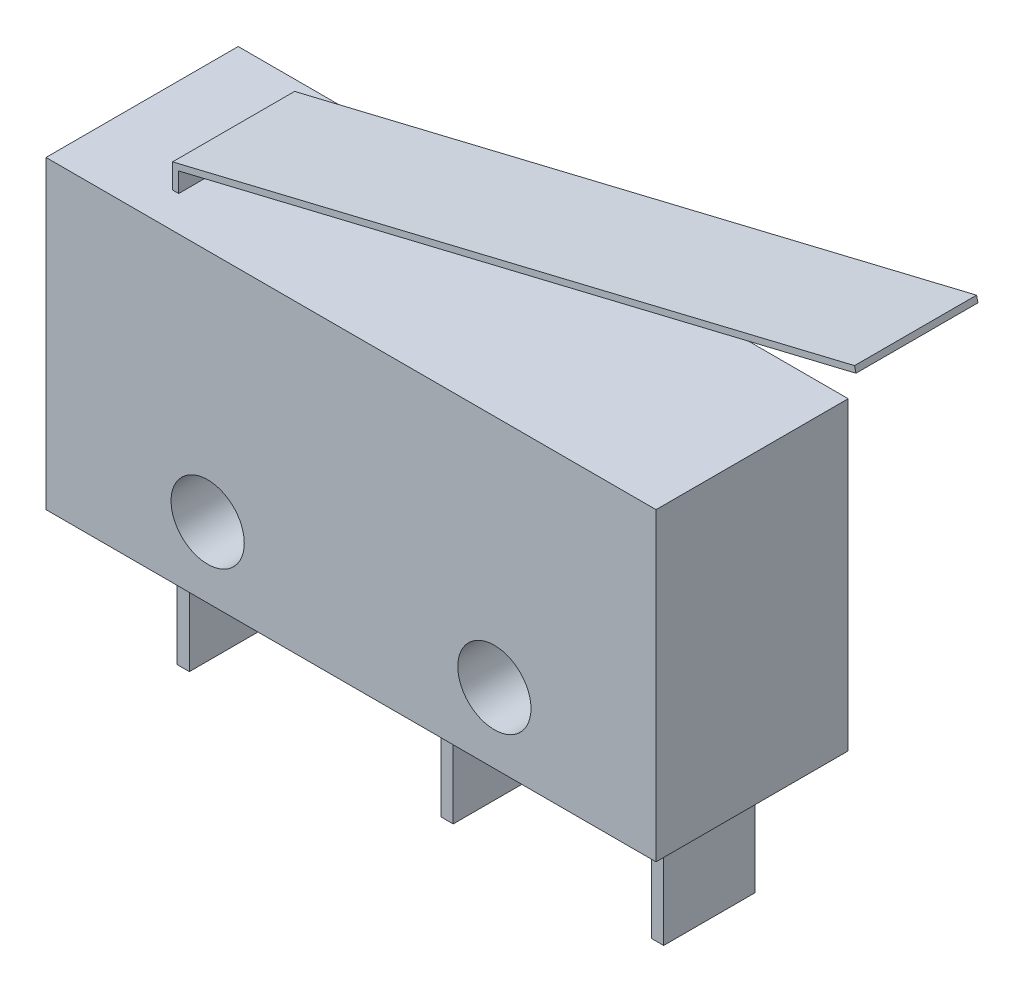
ISO-10303-21;
HEADER;
FILE_DESCRIPTION(('STEP AP214'),'2;1');
FILE_NAME('part.step','',(''),(''),'','','');
FILE_SCHEMA(('AUTOMOTIVE_DESIGN { 1 0 10303 214 1 1 1 1 }'));
ENDSEC;
DATA;
#1=APPLICATION_CONTEXT('core data for automotive mechanical design processes');
#2=APPLICATION_PROTOCOL_DEFINITION('international standard','automotive_design',2000,#1);
#3=PRODUCT_CONTEXT('',#1,'mechanical');
#4=PRODUCT('Part','Part','',(#3));
#5=PRODUCT_RELATED_PRODUCT_CATEGORY('part','',(#4));
#6=PRODUCT_DEFINITION_FORMATION('','',#4);
#7=PRODUCT_DEFINITION_CONTEXT('part definition',#1,'design');
#8=PRODUCT_DEFINITION('design','',#6,#7);
#9=PRODUCT_DEFINITION_SHAPE('','',#8);
#10=(LENGTH_UNIT() NAMED_UNIT(*) SI_UNIT(.MILLI.,.METRE.));
#11=(NAMED_UNIT(*) PLANE_ANGLE_UNIT() SI_UNIT($,.RADIAN.));
#12=(NAMED_UNIT(*) SI_UNIT($,.STERADIAN.) SOLID_ANGLE_UNIT());
#13=UNCERTAINTY_MEASURE_WITH_UNIT(LENGTH_MEASURE(1.E-05),#10,'distance_accuracy_value','');
#14=(GEOMETRIC_REPRESENTATION_CONTEXT(3) GLOBAL_UNCERTAINTY_ASSIGNED_CONTEXT((#13)) GLOBAL_UNIT_ASSIGNED_CONTEXT((#10,
#11,#12)) REPRESENTATION_CONTEXT('',''));
#15=CARTESIAN_POINT('',(0.,0.,0.));
#16=DIRECTION('',(0.,0.,1.));
#17=DIRECTION('',(1.,0.,0.));
#18=AXIS2_PLACEMENT_3D('',#15,#16,#17);
#19=CARTESIAN_POINT('',(0.,0.,6.3));
#20=DIRECTION('',(0.,0.,-1.));
#21=DIRECTION('',(-1.,0.,0.));
#22=AXIS2_PLACEMENT_3D('',#19,#20,#21);
#23=PLANE('',#22);
#24=DIRECTION('',(-1.,0.,0.));
#25=VECTOR('',#24,1.);
#26=CARTESIAN_POINT('',(-6.8,5.,6.3));
#27=LINE('',#26,#25);
#28=CARTESIAN_POINT('',(10.,5.,6.3));
#29=VERTEX_POINT('',#28);
#30=CARTESIAN_POINT('',(-10.,5.,6.3));
#31=VERTEX_POINT('',#30);
#32=EDGE_CURVE('E289',#29,#31,#27,.T.);
#33=ORIENTED_EDGE('',*,*,#32,.T.);
#34=DIRECTION('',(0.,-1.,0.));
#35=VECTOR('',#34,1.);
#36=CARTESIAN_POINT('',(-10.,5.,6.3));
#37=LINE('',#36,#35);
#38=CARTESIAN_POINT('',(-10.,-5.,6.3));
#39=VERTEX_POINT('',#38);
#40=EDGE_CURVE('E291',#31,#39,#37,.T.);
#41=ORIENTED_EDGE('',*,*,#40,.T.);
#42=DIRECTION('',(1.,0.,0.));
#43=VECTOR('',#42,1.);
#44=CARTESIAN_POINT('',(8.6,-5.,6.3));
#45=LINE('',#44,#43);
#46=CARTESIAN_POINT('',(10.,-5.,6.3));
#47=VERTEX_POINT('',#46);
#48=EDGE_CURVE('E283',#39,#47,#45,.T.);
#49=ORIENTED_EDGE('',*,*,#48,.T.);
#50=DIRECTION('',(0.,1.,0.));
#51=VECTOR('',#50,1.);
#52=CARTESIAN_POINT('',(10.,5.,6.3));
#53=LINE('',#52,#51);
#54=EDGE_CURVE('E286',#47,#29,#53,.T.);
#55=ORIENTED_EDGE('',*,*,#54,.T.);
#56=EDGE_LOOP('',(#33,#41,#49,#55));
#57=FACE_BOUND('',#56,.T.);
#58=CARTESIAN_POINT('',(-4.7,-2.7,6.3));
#59=DIRECTION('',(0.,0.,1.));
#60=DIRECTION('',(1.,0.,0.));
#61=AXIS2_PLACEMENT_3D('',#58,#59,#60);
#62=CIRCLE('',#61,1.2);
#63=CARTESIAN_POINT('',(-3.5,-2.7,6.3));
#64=VERTEX_POINT('',#63);
#65=EDGE_CURVE('E277',#64,#64,#62,.T.);
#66=ORIENTED_EDGE('',*,*,#65,.F.);
#67=EDGE_LOOP('',(#66));
#68=FACE_BOUND('',#67,.T.);
#69=CARTESIAN_POINT('',(4.7,-2.7,6.3));
#70=DIRECTION('',(0.,0.,1.));
#71=DIRECTION('',(1.,0.,0.));
#72=AXIS2_PLACEMENT_3D('',#69,#70,#71);
#73=CIRCLE('',#72,1.2);
#74=CARTESIAN_POINT('',(5.9,-2.7,6.3));
#75=VERTEX_POINT('',#74);
#76=EDGE_CURVE('E271',#75,#75,#73,.T.);
#77=ORIENTED_EDGE('',*,*,#76,.F.);
#78=EDGE_LOOP('',(#77));
#79=FACE_BOUND('',#78,.T.);
#80=ADVANCED_FACE('F34',(#57,#68,#79),#23,.F.);
#81=CARTESIAN_POINT('',(0.,0.,0.));
#82=DIRECTION('',(0.,0.,-1.));
#83=DIRECTION('',(-1.,0.,0.));
#84=AXIS2_PLACEMENT_3D('',#81,#82,#83);
#85=PLANE('',#84);
#86=DIRECTION('',(-1.,0.,0.));
#87=VECTOR('',#86,1.);
#88=CARTESIAN_POINT('',(-10.,5.,0.));
#89=LINE('',#88,#87);
#90=CARTESIAN_POINT('',(10.,5.,0.));
#91=VERTEX_POINT('',#90);
#92=CARTESIAN_POINT('',(-10.,5.,0.));
#93=VERTEX_POINT('',#92);
#94=EDGE_CURVE('E296',#91,#93,#89,.T.);
#95=ORIENTED_EDGE('',*,*,#94,.F.);
#96=DIRECTION('',(0.,1.,0.));
#97=VECTOR('',#96,1.);
#98=CARTESIAN_POINT('',(10.,5.,0.));
#99=LINE('',#98,#97);
#100=CARTESIAN_POINT('',(10.,-5.,0.));
#101=VERTEX_POINT('',#100);
#102=EDGE_CURVE('E280',#101,#91,#99,.T.);
#103=ORIENTED_EDGE('',*,*,#102,.F.);
#104=DIRECTION('',(1.,0.,0.));
#105=VECTOR('',#104,1.);
#106=CARTESIAN_POINT('',(1.7,-5.,0.));
#107=LINE('',#106,#105);
#108=CARTESIAN_POINT('',(-10.,-5.,0.));
#109=VERTEX_POINT('',#108);
#110=EDGE_CURVE('E287',#109,#101,#107,.T.);
#111=ORIENTED_EDGE('',*,*,#110,.F.);
#112=DIRECTION('',(0.,-1.,0.));
#113=VECTOR('',#112,1.);
#114=CARTESIAN_POINT('',(-10.,5.,0.));
#115=LINE('',#114,#113);
#116=EDGE_CURVE('E298',#93,#109,#115,.T.);
#117=ORIENTED_EDGE('',*,*,#116,.F.);
#118=EDGE_LOOP('',(#95,#103,#111,#117));
#119=FACE_BOUND('',#118,.T.);
#120=CARTESIAN_POINT('',(-4.7,-2.7,0.));
#121=DIRECTION('',(0.,0.,1.));
#122=DIRECTION('',(1.,0.,0.));
#123=AXIS2_PLACEMENT_3D('',#120,#121,#122);
#124=CIRCLE('',#123,1.2);
#125=CARTESIAN_POINT('',(-3.5,-2.7,0.));
#126=VERTEX_POINT('',#125);
#127=EDGE_CURVE('E274',#126,#126,#124,.T.);
#128=ORIENTED_EDGE('',*,*,#127,.T.);
#129=EDGE_LOOP('',(#128));
#130=FACE_BOUND('',#129,.T.);
#131=CARTESIAN_POINT('',(4.7,-2.7,0.));
#132=DIRECTION('',(0.,0.,1.));
#133=DIRECTION('',(1.,0.,0.));
#134=AXIS2_PLACEMENT_3D('',#131,#132,#133);
#135=CIRCLE('',#134,1.2);
#136=CARTESIAN_POINT('',(5.9,-2.7,0.));
#137=VERTEX_POINT('',#136);
#138=EDGE_CURVE('E270',#137,#137,#135,.T.);
#139=ORIENTED_EDGE('',*,*,#138,.T.);
#140=EDGE_LOOP('',(#139));
#141=FACE_BOUND('',#140,.T.);
#142=ADVANCED_FACE('F337',(#119,#130,#141),#85,.T.);
#143=CARTESIAN_POINT('',(10.,5.,6.3));
#144=DIRECTION('',(-1.,0.,0.));
#145=DIRECTION('',(0.,0.,1.));
#146=AXIS2_PLACEMENT_3D('',#143,#144,#145);
#147=PLANE('',#146);
#148=ORIENTED_EDGE('',*,*,#102,.T.);
#149=DIRECTION('',(0.,0.,-1.));
#150=VECTOR('',#149,1.);
#151=CARTESIAN_POINT('',(10.,5.,6.3));
#152=LINE('',#151,#150);
#153=EDGE_CURVE('E215',#29,#91,#152,.T.);
#154=ORIENTED_EDGE('',*,*,#153,.F.);
#155=ORIENTED_EDGE('',*,*,#54,.F.);
#156=DIRECTION('',(0.,0.,-1.));
#157=VECTOR('',#156,1.);
#158=CARTESIAN_POINT('',(10.,-5.,6.3));
#159=LINE('',#158,#157);
#160=EDGE_CURVE('E217',#47,#101,#159,.T.);
#161=ORIENTED_EDGE('',*,*,#160,.T.);
#162=EDGE_LOOP('',(#148,#154,#155,#161));
#163=FACE_BOUND('',#162,.T.);
#164=ADVANCED_FACE('F36',(#163),#147,.F.);
#165=CARTESIAN_POINT('',(-6.80000000000001,5.64251520211059,6.3));
#166=DIRECTION('',(-1.,0.,0.));
#167=DIRECTION('',(0.,-1.,0.));
#168=AXIS2_PLACEMENT_3D('',#165,#166,#167);
#169=PLANE('',#168);
#170=DIRECTION('',(0.,0.,-1.));
#171=VECTOR('',#170,1.);
#172=CARTESIAN_POINT('',(-6.80000000000001,5.64251520211059,6.3));
#173=LINE('',#172,#171);
#174=CARTESIAN_POINT('',(-6.80000000000001,5.64251520211059,5.15));
#175=VERTEX_POINT('',#174);
#176=CARTESIAN_POINT('',(-6.80000000000001,5.64251520211059,1.15));
#177=VERTEX_POINT('',#176);
#178=EDGE_CURVE('E211',#175,#177,#173,.T.);
#179=ORIENTED_EDGE('',*,*,#178,.F.);
#180=DIRECTION('',(0.,-1.,0.));
#181=VECTOR('',#180,1.);
#182=CARTESIAN_POINT('',(-6.80000000000001,5.64251520211059,5.15));
#183=LINE('',#182,#181);
#184=CARTESIAN_POINT('',(-6.8,5.,5.15));
#185=VERTEX_POINT('',#184);
#186=EDGE_CURVE('E757',#175,#185,#183,.T.);
#187=ORIENTED_EDGE('',*,*,#186,.T.);
#188=DIRECTION('',(0.,0.,-1.));
#189=VECTOR('',#188,1.);
#190=CARTESIAN_POINT('',(-6.8,5.,6.3));
#191=LINE('',#190,#189);
#192=CARTESIAN_POINT('',(-6.8,5.,1.15));
#193=VERTEX_POINT('',#192);
#194=EDGE_CURVE('E213',#185,#193,#191,.T.);
#195=ORIENTED_EDGE('',*,*,#194,.T.);
#196=DIRECTION('',(0.,1.,0.));
#197=VECTOR('',#196,1.);
#198=CARTESIAN_POINT('',(-6.80000000000001,5.64251520211059,1.15));
#199=LINE('',#198,#197);
#200=EDGE_CURVE('E431',#193,#177,#199,.T.);
#201=ORIENTED_EDGE('',*,*,#200,.T.);
#202=EDGE_LOOP('',(#179,#187,#195,#201));
#203=FACE_BOUND('',#202,.T.);
#204=ADVANCED_FACE('F349',(#203),#169,.F.);
#205=CARTESIAN_POINT('',(-6.80000000000001,5.64251520211059,6.3));
#206=DIRECTION('',(-0.234540056140332,0.972106456138261,0.));
#207=DIRECTION('',(-0.972106456138262,-0.234540056140333,0.));
#208=AXIS2_PLACEMENT_3D('',#205,#206,#207);
#209=PLANE('',#208);
#210=DIRECTION('',(0.,0.,-1.));
#211=VECTOR('',#210,1.);
#212=CARTESIAN_POINT('',(15.4053565024081,11.,6.3));
#213=LINE('',#212,#211);
#214=CARTESIAN_POINT('',(15.4053565024081,11.,5.15));
#215=VERTEX_POINT('',#214);
#216=CARTESIAN_POINT('',(15.4053565024081,11.,1.15));
#217=VERTEX_POINT('',#216);
#218=EDGE_CURVE('E204',#215,#217,#213,.T.);
#219=ORIENTED_EDGE('',*,*,#218,.F.);
#220=DIRECTION('',(-0.972106456138262,-0.234540056140333,0.));
#221=VECTOR('',#220,1.);
#222=CARTESIAN_POINT('',(-6.80000000000001,5.64251520211059,5.15));
#223=LINE('',#222,#221);
#224=EDGE_CURVE('E418',#215,#175,#223,.T.);
#225=ORIENTED_EDGE('',*,*,#224,.T.);
#226=ORIENTED_EDGE('',*,*,#178,.T.);
#227=DIRECTION('',(0.972106456138262,0.234540056140333,0.));
#228=VECTOR('',#227,1.);
#229=CARTESIAN_POINT('',(-6.80000000000001,5.64251520211059,1.15));
#230=LINE('',#229,#228);
#231=EDGE_CURVE('E421',#177,#217,#230,.T.);
#232=ORIENTED_EDGE('',*,*,#231,.T.);
#233=EDGE_LOOP('',(#219,#225,#226,#232));
#234=FACE_BOUND('',#233,.T.);
#235=ADVANCED_FACE('F354',(#234),#209,.F.);
#236=CARTESIAN_POINT('',(15.4053565024081,11.,6.3));
#237=DIRECTION('',(-0.972106456138265,-0.234540056140318,0.));
#238=DIRECTION('',(0.234540056140318,-0.972106456138265,0.));
#239=AXIS2_PLACEMENT_3D('',#236,#237,#238);
#240=PLANE('',#239);
#241=DIRECTION('',(0.,0.,-1.));
#242=VECTOR('',#241,1.);
#243=CARTESIAN_POINT('',(15.35844849118,11.1944212912277,6.3));
#244=LINE('',#243,#242);
#245=CARTESIAN_POINT('',(15.35844849118,11.1944212912277,5.15));
#246=VERTEX_POINT('',#245);
#247=CARTESIAN_POINT('',(15.35844849118,11.1944212912277,1.15));
#248=VERTEX_POINT('',#247);
#249=EDGE_CURVE('E202',#246,#248,#244,.T.);
#250=ORIENTED_EDGE('',*,*,#249,.F.);
#251=DIRECTION('',(0.234540056140318,-0.972106456138265,0.));
#252=VECTOR('',#251,1.);
#253=CARTESIAN_POINT('',(15.4053565024081,11.,5.15));
#254=LINE('',#253,#252);
#255=EDGE_CURVE('E184',#246,#215,#254,.T.);
#256=ORIENTED_EDGE('',*,*,#255,.T.);
#257=ORIENTED_EDGE('',*,*,#218,.T.);
#258=DIRECTION('',(-0.234540056140318,0.972106456138265,0.));
#259=VECTOR('',#258,1.);
#260=CARTESIAN_POINT('',(15.4053565024081,11.,1.15));
#261=LINE('',#260,#259);
#262=EDGE_CURVE('E424',#217,#248,#261,.T.);
#263=ORIENTED_EDGE('',*,*,#262,.T.);
#264=EDGE_LOOP('',(#250,#256,#257,#263));
#265=FACE_BOUND('',#264,.T.);
#266=ADVANCED_FACE('F407',(#265),#240,.F.);
#267=CARTESIAN_POINT('',(15.35844849118,11.1944212912277,6.3));
#268=DIRECTION('',(0.234540056140333,-0.972106456138262,0.));
#269=DIRECTION('',(0.972106456138262,0.234540056140333,0.));
#270=AXIS2_PLACEMENT_3D('',#267,#268,#269);
#271=PLANE('',#270);
#272=DIRECTION('',(0.,0.,-1.));
#273=VECTOR('',#272,1.);
#274=CARTESIAN_POINT('',(-7.,5.8,6.3));
#275=LINE('',#274,#273);
#276=CARTESIAN_POINT('',(-7.,5.8,5.15));
#277=VERTEX_POINT('',#276);
#278=CARTESIAN_POINT('',(-7.,5.8,1.15));
#279=VERTEX_POINT('',#278);
#280=EDGE_CURVE('E194',#277,#279,#275,.T.);
#281=ORIENTED_EDGE('',*,*,#280,.F.);
#282=DIRECTION('',(0.972106456138262,0.234540056140333,0.));
#283=VECTOR('',#282,1.);
#284=CARTESIAN_POINT('',(15.35844849118,11.1944212912277,5.15));
#285=LINE('',#284,#283);
#286=EDGE_CURVE('E181',#277,#246,#285,.T.);
#287=ORIENTED_EDGE('',*,*,#286,.T.);
#288=ORIENTED_EDGE('',*,*,#249,.T.);
#289=DIRECTION('',(-0.972106456138262,-0.234540056140333,0.));
#290=VECTOR('',#289,1.);
#291=CARTESIAN_POINT('',(15.35844849118,11.1944212912277,1.15));
#292=LINE('',#291,#290);
#293=EDGE_CURVE('E201',#248,#279,#292,.T.);
#294=ORIENTED_EDGE('',*,*,#293,.T.);
#295=EDGE_LOOP('',(#281,#287,#288,#294));
#296=FACE_BOUND('',#295,.T.);
#297=ADVANCED_FACE('F199',(#296),#271,.F.);
#298=CARTESIAN_POINT('',(-7.,5.8,6.3));
#299=DIRECTION('',(1.,0.,0.));
#300=DIRECTION('',(0.,0.,-1.));
#301=AXIS2_PLACEMENT_3D('',#298,#299,#300);
#302=PLANE('',#301);
#303=DIRECTION('',(0.,0.,-1.));
#304=VECTOR('',#303,1.);
#305=CARTESIAN_POINT('',(-7.,5.,6.3));
#306=LINE('',#305,#304);
#307=CARTESIAN_POINT('',(-7.,5.,5.15));
#308=VERTEX_POINT('',#307);
#309=CARTESIAN_POINT('',(-7.,5.,1.15));
#310=VERTEX_POINT('',#309);
#311=EDGE_CURVE('E196',#308,#310,#306,.T.);
#312=ORIENTED_EDGE('',*,*,#311,.F.);
#313=DIRECTION('',(0.,-1.,0.));
#314=VECTOR('',#313,1.);
#315=CARTESIAN_POINT('',(-7.,5.,5.15));
#316=LINE('',#315,#314);
#317=EDGE_CURVE('E49',#277,#308,#316,.T.);
#318=ORIENTED_EDGE('',*,*,#317,.F.);
#319=ORIENTED_EDGE('',*,*,#280,.T.);
#320=DIRECTION('',(0.,1.,0.));
#321=VECTOR('',#320,1.);
#322=CARTESIAN_POINT('',(-7.,5.,1.15));
#323=LINE('',#322,#321);
#324=EDGE_CURVE('E756',#310,#279,#323,.T.);
#325=ORIENTED_EDGE('',*,*,#324,.F.);
#326=EDGE_LOOP('',(#312,#318,#319,#325));
#327=FACE_BOUND('',#326,.T.);
#328=ADVANCED_FACE('F192',(#327),#302,.F.);
#329=CARTESIAN_POINT('',(-10.,5.,6.3));
#330=DIRECTION('',(0.,-1.,0.));
#331=DIRECTION('',(0.,0.,-1.));
#332=AXIS2_PLACEMENT_3D('',#329,#330,#331);
#333=PLANE('',#332);
#334=ORIENTED_EDGE('',*,*,#194,.F.);
#335=DIRECTION('',(-1.,0.,0.));
#336=VECTOR('',#335,1.);
#337=CARTESIAN_POINT('',(15.4053565024081,5.,5.15));
#338=LINE('',#337,#336);
#339=EDGE_CURVE('E188',#185,#308,#338,.T.);
#340=ORIENTED_EDGE('',*,*,#339,.T.);
#341=ORIENTED_EDGE('',*,*,#311,.T.);
#342=DIRECTION('',(-1.,0.,0.));
#343=VECTOR('',#342,1.);
#344=CARTESIAN_POINT('',(15.4053565024081,5.,1.15));
#345=LINE('',#344,#343);
#346=EDGE_CURVE('E433',#193,#310,#345,.T.);
#347=ORIENTED_EDGE('',*,*,#346,.F.);
#348=EDGE_LOOP('',(#334,#340,#341,#347));
#349=FACE_BOUND('',#348,.T.);
#350=DIRECTION('',(0.,0.,-1.));
#351=VECTOR('',#350,1.);
#352=CARTESIAN_POINT('',(-10.,5.,6.3));
#353=LINE('',#352,#351);
#354=EDGE_CURVE('E206',#31,#93,#353,.T.);
#355=ORIENTED_EDGE('',*,*,#354,.F.);
#356=ORIENTED_EDGE('',*,*,#32,.F.);
#357=ORIENTED_EDGE('',*,*,#153,.T.);
#358=ORIENTED_EDGE('',*,*,#94,.T.);
#359=EDGE_LOOP('',(#355,#356,#357,#358));
#360=FACE_BOUND('',#359,.T.);
#361=ADVANCED_FACE('F346',(#349,#360),#333,.F.);
#362=CARTESIAN_POINT('',(-10.,5.,6.3));
#363=DIRECTION('',(1.,0.,0.));
#364=DIRECTION('',(0.,0.,-1.));
#365=AXIS2_PLACEMENT_3D('',#362,#363,#364);
#366=PLANE('',#365);
#367=ORIENTED_EDGE('',*,*,#116,.T.);
#368=DIRECTION('',(0.,0.,-1.));
#369=VECTOR('',#368,1.);
#370=CARTESIAN_POINT('',(-10.,-5.,6.3));
#371=LINE('',#370,#369);
#372=EDGE_CURVE('E324',#39,#109,#371,.T.);
#373=ORIENTED_EDGE('',*,*,#372,.F.);
#374=ORIENTED_EDGE('',*,*,#40,.F.);
#375=ORIENTED_EDGE('',*,*,#354,.T.);
#376=EDGE_LOOP('',(#367,#373,#374,#375));
#377=FACE_BOUND('',#376,.T.);
#378=ADVANCED_FACE('F330',(#377),#366,.F.);
#379=CARTESIAN_POINT('',(-7.35,-5.,6.3));
#380=DIRECTION('',(1.,0.,0.));
#381=DIRECTION('',(0.,1.,0.));
#382=AXIS2_PLACEMENT_3D('',#379,#380,#381);
#383=PLANE('',#382);
#384=DIRECTION('',(0.,0.,-1.));
#385=VECTOR('',#384,1.);
#386=CARTESIAN_POINT('',(-7.35,-8.9,6.3));
#387=LINE('',#386,#385);
#388=CARTESIAN_POINT('',(-7.35,-8.9,4.65));
#389=VERTEX_POINT('',#388);
#390=CARTESIAN_POINT('',(-7.35,-8.9,1.65));
#391=VERTEX_POINT('',#390);
#392=EDGE_CURVE('E320',#389,#391,#387,.T.);
#393=ORIENTED_EDGE('',*,*,#392,.F.);
#394=DIRECTION('',(0.,1.,0.));
#395=VECTOR('',#394,1.);
#396=CARTESIAN_POINT('',(-7.35,-5.,4.65));
#397=LINE('',#396,#395);
#398=CARTESIAN_POINT('',(-7.35,-5.,4.65));
#399=VERTEX_POINT('',#398);
#400=EDGE_CURVE('E456',#389,#399,#397,.T.);
#401=ORIENTED_EDGE('',*,*,#400,.T.);
#402=DIRECTION('',(0.,0.,-1.));
#403=VECTOR('',#402,1.);
#404=CARTESIAN_POINT('',(-7.35,-5.,6.3));
#405=LINE('',#404,#403);
#406=CARTESIAN_POINT('',(-7.35,-5.,1.65));
#407=VERTEX_POINT('',#406);
#408=EDGE_CURVE('E322',#399,#407,#405,.T.);
#409=ORIENTED_EDGE('',*,*,#408,.T.);
#410=DIRECTION('',(0.,-1.,0.));
#411=VECTOR('',#410,1.);
#412=CARTESIAN_POINT('',(-7.35,-5.,1.65));
#413=LINE('',#412,#411);
#414=EDGE_CURVE('E267',#407,#391,#413,.T.);
#415=ORIENTED_EDGE('',*,*,#414,.T.);
#416=EDGE_LOOP('',(#393,#401,#409,#415));
#417=FACE_BOUND('',#416,.T.);
#418=ADVANCED_FACE('F394',(#417),#383,.F.);
#419=CARTESIAN_POINT('',(-6.95,-8.9,6.3));
#420=DIRECTION('',(0.,1.,0.));
#421=DIRECTION('',(-1.,0.,0.));
#422=AXIS2_PLACEMENT_3D('',#419,#420,#421);
#423=PLANE('',#422);
#424=DIRECTION('',(0.,0.,-1.));
#425=VECTOR('',#424,1.);
#426=CARTESIAN_POINT('',(-6.95,-8.9,6.3));
#427=LINE('',#426,#425);
#428=CARTESIAN_POINT('',(-6.95,-8.9,4.65));
#429=VERTEX_POINT('',#428);
#430=CARTESIAN_POINT('',(-6.95,-8.9,1.65));
#431=VERTEX_POINT('',#430);
#432=EDGE_CURVE('E318',#429,#431,#427,.T.);
#433=ORIENTED_EDGE('',*,*,#432,.F.);
#434=DIRECTION('',(1.,0.,0.));
#435=VECTOR('',#434,1.);
#436=CARTESIAN_POINT('',(-10.,-8.9,4.65));
#437=LINE('',#436,#435);
#438=EDGE_CURVE('E57',#389,#429,#437,.T.);
#439=ORIENTED_EDGE('',*,*,#438,.F.);
#440=ORIENTED_EDGE('',*,*,#392,.T.);
#441=DIRECTION('',(1.,0.,0.));
#442=VECTOR('',#441,1.);
#443=CARTESIAN_POINT('',(-10.,-8.9,1.65));
#444=LINE('',#443,#442);
#445=EDGE_CURVE('E244',#391,#431,#444,.T.);
#446=ORIENTED_EDGE('',*,*,#445,.T.);
#447=EDGE_LOOP('',(#433,#439,#440,#446));
#448=FACE_BOUND('',#447,.T.);
#449=ADVANCED_FACE('F390',(#448),#423,.F.);
#450=CARTESIAN_POINT('',(-6.95,-5.,6.3));
#451=DIRECTION('',(-1.,0.,0.));
#452=DIRECTION('',(0.,-1.,0.));
#453=AXIS2_PLACEMENT_3D('',#450,#451,#452);
#454=PLANE('',#453);
#455=DIRECTION('',(0.,0.,-1.));
#456=VECTOR('',#455,1.);
#457=CARTESIAN_POINT('',(-6.95,-5.,6.3));
#458=LINE('',#457,#456);
#459=CARTESIAN_POINT('',(-6.95,-5.,4.65));
#460=VERTEX_POINT('',#459);
#461=CARTESIAN_POINT('',(-6.95,-5.,1.65));
#462=VERTEX_POINT('',#461);
#463=EDGE_CURVE('E316',#460,#462,#458,.T.);
#464=ORIENTED_EDGE('',*,*,#463,.F.);
#465=DIRECTION('',(0.,-1.,0.));
#466=VECTOR('',#465,1.);
#467=CARTESIAN_POINT('',(-6.95,-5.,4.65));
#468=LINE('',#467,#466);
#469=EDGE_CURVE('E455',#460,#429,#468,.T.);
#470=ORIENTED_EDGE('',*,*,#469,.T.);
#471=ORIENTED_EDGE('',*,*,#432,.T.);
#472=DIRECTION('',(0.,1.,0.));
#473=VECTOR('',#472,1.);
#474=CARTESIAN_POINT('',(-6.95,-5.,1.65));
#475=LINE('',#474,#473);
#476=EDGE_CURVE('E264',#431,#462,#475,.T.);
#477=ORIENTED_EDGE('',*,*,#476,.T.);
#478=EDGE_LOOP('',(#464,#470,#471,#477));
#479=FACE_BOUND('',#478,.T.);
#480=ADVANCED_FACE('F386',(#479),#454,.F.);
#481=CARTESIAN_POINT('',(1.3,-5.,6.3));
#482=DIRECTION('',(1.,0.,0.));
#483=DIRECTION('',(0.,1.,0.));
#484=AXIS2_PLACEMENT_3D('',#481,#482,#483);
#485=PLANE('',#484);
#486=DIRECTION('',(0.,0.,-1.));
#487=VECTOR('',#486,1.);
#488=CARTESIAN_POINT('',(1.3,-8.9,6.3));
#489=LINE('',#488,#487);
#490=CARTESIAN_POINT('',(1.3,-8.9,4.65));
#491=VERTEX_POINT('',#490);
#492=CARTESIAN_POINT('',(1.3,-8.9,1.65));
#493=VERTEX_POINT('',#492);
#494=EDGE_CURVE('E312',#491,#493,#489,.T.);
#495=ORIENTED_EDGE('',*,*,#494,.F.);
#496=DIRECTION('',(0.,1.,0.));
#497=VECTOR('',#496,1.);
#498=CARTESIAN_POINT('',(1.3,-5.,4.65));
#499=LINE('',#498,#497);
#500=CARTESIAN_POINT('',(1.3,-5.,4.65));
#501=VERTEX_POINT('',#500);
#502=EDGE_CURVE('E452',#491,#501,#499,.T.);
#503=ORIENTED_EDGE('',*,*,#502,.T.);
#504=DIRECTION('',(0.,0.,-1.));
#505=VECTOR('',#504,1.);
#506=CARTESIAN_POINT('',(1.3,-5.,6.3));
#507=LINE('',#506,#505);
#508=CARTESIAN_POINT('',(1.3,-5.,1.65));
#509=VERTEX_POINT('',#508);
#510=EDGE_CURVE('E314',#501,#509,#507,.T.);
#511=ORIENTED_EDGE('',*,*,#510,.T.);
#512=DIRECTION('',(0.,-1.,0.));
#513=VECTOR('',#512,1.);
#514=CARTESIAN_POINT('',(1.3,-5.,1.65));
#515=LINE('',#514,#513);
#516=EDGE_CURVE('E259',#509,#493,#515,.T.);
#517=ORIENTED_EDGE('',*,*,#516,.T.);
#518=EDGE_LOOP('',(#495,#503,#511,#517));
#519=FACE_BOUND('',#518,.T.);
#520=ADVANCED_FACE('F382',(#519),#485,.F.);
#521=CARTESIAN_POINT('',(1.7,-8.9,6.3));
#522=DIRECTION('',(0.,1.,0.));
#523=DIRECTION('',(-1.,0.,0.));
#524=AXIS2_PLACEMENT_3D('',#521,#522,#523);
#525=PLANE('',#524);
#526=DIRECTION('',(0.,0.,-1.));
#527=VECTOR('',#526,1.);
#528=CARTESIAN_POINT('',(1.7,-8.9,6.3));
#529=LINE('',#528,#527);
#530=CARTESIAN_POINT('',(1.7,-8.9,4.65));
#531=VERTEX_POINT('',#530);
#532=CARTESIAN_POINT('',(1.7,-8.9,1.65));
#533=VERTEX_POINT('',#532);
#534=EDGE_CURVE('E310',#531,#533,#529,.T.);
#535=ORIENTED_EDGE('',*,*,#534,.F.);
#536=EDGE_CURVE('E445',#491,#531,#437,.T.);
#537=ORIENTED_EDGE('',*,*,#536,.F.);
#538=ORIENTED_EDGE('',*,*,#494,.T.);
#539=EDGE_CURVE('E241',#493,#533,#444,.T.);
#540=ORIENTED_EDGE('',*,*,#539,.T.);
#541=EDGE_LOOP('',(#535,#537,#538,#540));
#542=FACE_BOUND('',#541,.T.);
#543=ADVANCED_FACE('F378',(#542),#525,.F.);
#544=CARTESIAN_POINT('',(1.7,-5.,6.3));
#545=DIRECTION('',(-1.,0.,0.));
#546=DIRECTION('',(0.,-1.,0.));
#547=AXIS2_PLACEMENT_3D('',#544,#545,#546);
#548=PLANE('',#547);
#549=DIRECTION('',(0.,0.,-1.));
#550=VECTOR('',#549,1.);
#551=CARTESIAN_POINT('',(1.7,-5.,6.3));
#552=LINE('',#551,#550);
#553=CARTESIAN_POINT('',(1.7,-5.,4.65));
#554=VERTEX_POINT('',#553);
#555=CARTESIAN_POINT('',(1.7,-5.,1.65));
#556=VERTEX_POINT('',#555);
#557=EDGE_CURVE('E308',#554,#556,#552,.T.);
#558=ORIENTED_EDGE('',*,*,#557,.F.);
#559=DIRECTION('',(0.,-1.,0.));
#560=VECTOR('',#559,1.);
#561=CARTESIAN_POINT('',(1.7,-5.,4.65));
#562=LINE('',#561,#560);
#563=EDGE_CURVE('E449',#554,#531,#562,.T.);
#564=ORIENTED_EDGE('',*,*,#563,.T.);
#565=ORIENTED_EDGE('',*,*,#534,.T.);
#566=DIRECTION('',(0.,1.,0.));
#567=VECTOR('',#566,1.);
#568=CARTESIAN_POINT('',(1.7,-5.,1.65));
#569=LINE('',#568,#567);
#570=EDGE_CURVE('E255',#533,#556,#569,.T.);
#571=ORIENTED_EDGE('',*,*,#570,.T.);
#572=EDGE_LOOP('',(#558,#564,#565,#571));
#573=FACE_BOUND('',#572,.T.);
#574=ADVANCED_FACE('F374',(#573),#548,.F.);
#575=CARTESIAN_POINT('',(1.7,-5.,6.3));
#576=DIRECTION('',(0.,1.,0.));
#577=DIRECTION('',(0.,0.,1.));
#578=AXIS2_PLACEMENT_3D('',#575,#576,#577);
#579=PLANE('',#578);
#580=ORIENTED_EDGE('',*,*,#408,.F.);
#581=DIRECTION('',(1.,0.,0.));
#582=VECTOR('',#581,1.);
#583=CARTESIAN_POINT('',(-10.,-5.,4.65));
#584=LINE('',#583,#582);
#585=EDGE_CURVE('E443',#399,#460,#584,.T.);
#586=ORIENTED_EDGE('',*,*,#585,.T.);
#587=ORIENTED_EDGE('',*,*,#463,.T.);
#588=DIRECTION('',(1.,0.,0.));
#589=VECTOR('',#588,1.);
#590=CARTESIAN_POINT('',(-10.,-5.,1.65));
#591=LINE('',#590,#589);
#592=EDGE_CURVE('E242',#407,#462,#591,.T.);
#593=ORIENTED_EDGE('',*,*,#592,.F.);
#594=EDGE_LOOP('',(#580,#586,#587,#593));
#595=FACE_BOUND('',#594,.T.);
#596=ORIENTED_EDGE('',*,*,#510,.F.);
#597=EDGE_CURVE('E442',#501,#554,#584,.T.);
#598=ORIENTED_EDGE('',*,*,#597,.T.);
#599=ORIENTED_EDGE('',*,*,#557,.T.);
#600=EDGE_CURVE('E247',#509,#556,#591,.T.);
#601=ORIENTED_EDGE('',*,*,#600,.F.);
#602=EDGE_LOOP('',(#596,#598,#599,#601));
#603=FACE_BOUND('',#602,.T.);
#604=CARTESIAN_POINT('',(8.2,-5.,4.65));
#605=VERTEX_POINT('',#604);
#606=CARTESIAN_POINT('',(8.6,-5.,4.65));
#607=VERTEX_POINT('',#606);
#608=EDGE_CURVE('E439',#605,#607,#584,.T.);
#609=ORIENTED_EDGE('',*,*,#608,.T.);
#610=DIRECTION('',(0.,0.,-1.));
#611=VECTOR('',#610,1.);
#612=CARTESIAN_POINT('',(8.6,-5.,6.3));
#613=LINE('',#612,#611);
#614=CARTESIAN_POINT('',(8.6,-5.,1.65));
#615=VERTEX_POINT('',#614);
#616=EDGE_CURVE('E223',#607,#615,#613,.T.);
#617=ORIENTED_EDGE('',*,*,#616,.T.);
#618=CARTESIAN_POINT('',(8.2,-5.,1.65));
#619=VERTEX_POINT('',#618);
#620=EDGE_CURVE('E235',#619,#615,#591,.T.);
#621=ORIENTED_EDGE('',*,*,#620,.F.);
#622=DIRECTION('',(0.,0.,-1.));
#623=VECTOR('',#622,1.);
#624=CARTESIAN_POINT('',(8.2,-5.,6.3));
#625=LINE('',#624,#623);
#626=EDGE_CURVE('E306',#605,#619,#625,.T.);
#627=ORIENTED_EDGE('',*,*,#626,.F.);
#628=EDGE_LOOP('',(#609,#617,#621,#627));
#629=FACE_BOUND('',#628,.T.);
#630=ORIENTED_EDGE('',*,*,#110,.T.);
#631=ORIENTED_EDGE('',*,*,#160,.F.);
#632=ORIENTED_EDGE('',*,*,#48,.F.);
#633=ORIENTED_EDGE('',*,*,#372,.T.);
#634=EDGE_LOOP('',(#630,#631,#632,#633));
#635=FACE_BOUND('',#634,.T.);
#636=ADVANCED_FACE('F342',(#595,#603,#629,#635),#579,.F.);
#637=CARTESIAN_POINT('',(8.2,-5.,6.3));
#638=DIRECTION('',(1.,0.,0.));
#639=DIRECTION('',(0.,0.,-1.));
#640=AXIS2_PLACEMENT_3D('',#637,#638,#639);
#641=PLANE('',#640);
#642=DIRECTION('',(0.,0.,-1.));
#643=VECTOR('',#642,1.);
#644=CARTESIAN_POINT('',(8.2,-8.9,6.3));
#645=LINE('',#644,#643);
#646=CARTESIAN_POINT('',(8.2,-8.9,4.65));
#647=VERTEX_POINT('',#646);
#648=CARTESIAN_POINT('',(8.2,-8.9,1.65));
#649=VERTEX_POINT('',#648);
#650=EDGE_CURVE('E240',#647,#649,#645,.T.);
#651=ORIENTED_EDGE('',*,*,#650,.F.);
#652=DIRECTION('',(0.,1.,0.));
#653=VECTOR('',#652,1.);
#654=CARTESIAN_POINT('',(8.2,-5.,4.65));
#655=LINE('',#654,#653);
#656=EDGE_CURVE('E446',#647,#605,#655,.T.);
#657=ORIENTED_EDGE('',*,*,#656,.T.);
#658=ORIENTED_EDGE('',*,*,#626,.T.);
#659=DIRECTION('',(0.,-1.,0.));
#660=VECTOR('',#659,1.);
#661=CARTESIAN_POINT('',(8.2,-5.,1.65));
#662=LINE('',#661,#660);
#663=EDGE_CURVE('E251',#619,#649,#662,.T.);
#664=ORIENTED_EDGE('',*,*,#663,.T.);
#665=EDGE_LOOP('',(#651,#657,#658,#664));
#666=FACE_BOUND('',#665,.T.);
#667=ADVANCED_FACE('F369',(#666),#641,.F.);
#668=CARTESIAN_POINT('',(8.6,-8.9,6.3));
#669=DIRECTION('',(0.,1.,0.));
#670=DIRECTION('',(-1.,0.,0.));
#671=AXIS2_PLACEMENT_3D('',#668,#669,#670);
#672=PLANE('',#671);
#673=DIRECTION('',(0.,0.,-1.));
#674=VECTOR('',#673,1.);
#675=CARTESIAN_POINT('',(8.6,-8.9,6.3));
#676=LINE('',#675,#674);
#677=CARTESIAN_POINT('',(8.6,-8.9,4.65));
#678=VERTEX_POINT('',#677);
#679=CARTESIAN_POINT('',(8.6,-8.9,1.65));
#680=VERTEX_POINT('',#679);
#681=EDGE_CURVE('E225',#678,#680,#676,.T.);
#682=ORIENTED_EDGE('',*,*,#681,.F.);
#683=EDGE_CURVE('E438',#647,#678,#437,.T.);
#684=ORIENTED_EDGE('',*,*,#683,.F.);
#685=ORIENTED_EDGE('',*,*,#650,.T.);
#686=EDGE_CURVE('E232',#649,#680,#444,.T.);
#687=ORIENTED_EDGE('',*,*,#686,.T.);
#688=EDGE_LOOP('',(#682,#684,#685,#687));
#689=FACE_BOUND('',#688,.T.);
#690=ADVANCED_FACE('F237',(#689),#672,.F.);
#691=CARTESIAN_POINT('',(8.6,-5.,6.3));
#692=DIRECTION('',(-1.,0.,0.));
#693=DIRECTION('',(0.,0.,1.));
#694=AXIS2_PLACEMENT_3D('',#691,#692,#693);
#695=PLANE('',#694);
#696=ORIENTED_EDGE('',*,*,#616,.F.);
#697=DIRECTION('',(0.,-1.,0.));
#698=VECTOR('',#697,1.);
#699=CARTESIAN_POINT('',(8.6,-5.,4.65));
#700=LINE('',#699,#698);
#701=EDGE_CURVE('E11',#607,#678,#700,.T.);
#702=ORIENTED_EDGE('',*,*,#701,.T.);
#703=ORIENTED_EDGE('',*,*,#681,.T.);
#704=DIRECTION('',(0.,1.,0.));
#705=VECTOR('',#704,1.);
#706=CARTESIAN_POINT('',(8.6,-5.,1.65));
#707=LINE('',#706,#705);
#708=EDGE_CURVE('E42',#680,#615,#707,.T.);
#709=ORIENTED_EDGE('',*,*,#708,.T.);
#710=EDGE_LOOP('',(#696,#702,#703,#709));
#711=FACE_BOUND('',#710,.T.);
#712=ADVANCED_FACE('F222',(#711),#695,.F.);
#713=CARTESIAN_POINT('',(-4.7,-2.7,6.3));
#714=DIRECTION('',(0.,0.,-1.));
#715=DIRECTION('',(-1.,0.,0.));
#716=AXIS2_PLACEMENT_3D('',#713,#714,#715);
#717=CYLINDRICAL_SURFACE('',#716,1.2);
#718=ORIENTED_EDGE('',*,*,#65,.T.);
#719=EDGE_LOOP('',(#718));
#720=FACE_BOUND('',#719,.T.);
#721=ORIENTED_EDGE('',*,*,#127,.F.);
#722=EDGE_LOOP('',(#721));
#723=FACE_BOUND('',#722,.T.);
#724=ADVANCED_FACE('F362',(#720,#723),#717,.F.);
#725=CARTESIAN_POINT('',(4.7,-2.7,6.3));
#726=DIRECTION('',(0.,0.,-1.));
#727=DIRECTION('',(-1.,0.,0.));
#728=AXIS2_PLACEMENT_3D('',#725,#726,#727);
#729=CYLINDRICAL_SURFACE('',#728,1.2);
#730=ORIENTED_EDGE('',*,*,#76,.T.);
#731=EDGE_LOOP('',(#730));
#732=FACE_BOUND('',#731,.T.);
#733=ORIENTED_EDGE('',*,*,#138,.F.);
#734=EDGE_LOOP('',(#733));
#735=FACE_BOUND('',#734,.T.);
#736=ADVANCED_FACE('F497',(#732,#735),#729,.F.);
#737=CARTESIAN_POINT('',(-10.,-8.9,1.65));
#738=DIRECTION('',(0.,0.,1.));
#739=DIRECTION('',(1.,0.,0.));
#740=AXIS2_PLACEMENT_3D('',#737,#738,#739);
#741=PLANE('',#740);
#742=ORIENTED_EDGE('',*,*,#620,.T.);
#743=ORIENTED_EDGE('',*,*,#708,.F.);
#744=ORIENTED_EDGE('',*,*,#686,.F.);
#745=ORIENTED_EDGE('',*,*,#663,.F.);
#746=EDGE_LOOP('',(#742,#743,#744,#745));
#747=FACE_BOUND('',#746,.T.);
#748=ADVANCED_FACE('F230',(#747),#741,.F.);
#749=ORIENTED_EDGE('',*,*,#600,.T.);
#750=ORIENTED_EDGE('',*,*,#570,.F.);
#751=ORIENTED_EDGE('',*,*,#539,.F.);
#752=ORIENTED_EDGE('',*,*,#516,.F.);
#753=EDGE_LOOP('',(#749,#750,#751,#752));
#754=FACE_BOUND('',#753,.T.);
#755=ADVANCED_FACE('F465',(#754),#741,.F.);
#756=ORIENTED_EDGE('',*,*,#592,.T.);
#757=ORIENTED_EDGE('',*,*,#476,.F.);
#758=ORIENTED_EDGE('',*,*,#445,.F.);
#759=ORIENTED_EDGE('',*,*,#414,.F.);
#760=EDGE_LOOP('',(#756,#757,#758,#759));
#761=FACE_BOUND('',#760,.T.);
#762=ADVANCED_FACE('F481',(#761),#741,.F.);
#763=CARTESIAN_POINT('',(-10.,-8.9,4.65));
#764=DIRECTION('',(0.,0.,-1.));
#765=DIRECTION('',(-1.,0.,0.));
#766=AXIS2_PLACEMENT_3D('',#763,#764,#765);
#767=PLANE('',#766);
#768=ORIENTED_EDGE('',*,*,#683,.T.);
#769=ORIENTED_EDGE('',*,*,#701,.F.);
#770=ORIENTED_EDGE('',*,*,#608,.F.);
#771=ORIENTED_EDGE('',*,*,#656,.F.);
#772=EDGE_LOOP('',(#768,#769,#770,#771));
#773=FACE_BOUND('',#772,.T.);
#774=ADVANCED_FACE('F486',(#773),#767,.F.);
#775=ORIENTED_EDGE('',*,*,#536,.T.);
#776=ORIENTED_EDGE('',*,*,#563,.F.);
#777=ORIENTED_EDGE('',*,*,#597,.F.);
#778=ORIENTED_EDGE('',*,*,#502,.F.);
#779=EDGE_LOOP('',(#775,#776,#777,#778));
#780=FACE_BOUND('',#779,.T.);
#781=ADVANCED_FACE('F483',(#780),#767,.F.);
#782=ORIENTED_EDGE('',*,*,#438,.T.);
#783=ORIENTED_EDGE('',*,*,#469,.F.);
#784=ORIENTED_EDGE('',*,*,#585,.F.);
#785=ORIENTED_EDGE('',*,*,#400,.F.);
#786=EDGE_LOOP('',(#782,#783,#784,#785));
#787=FACE_BOUND('',#786,.T.);
#788=ADVANCED_FACE('F485',(#787),#767,.F.);
#789=CARTESIAN_POINT('',(15.4053565024081,5.,1.15));
#790=DIRECTION('',(0.,0.,1.));
#791=DIRECTION('',(1.,0.,0.));
#792=AXIS2_PLACEMENT_3D('',#789,#790,#791);
#793=PLANE('',#792);
#794=ORIENTED_EDGE('',*,*,#346,.T.);
#795=ORIENTED_EDGE('',*,*,#324,.T.);
#796=ORIENTED_EDGE('',*,*,#293,.F.);
#797=ORIENTED_EDGE('',*,*,#262,.F.);
#798=ORIENTED_EDGE('',*,*,#231,.F.);
#799=ORIENTED_EDGE('',*,*,#200,.F.);
#800=EDGE_LOOP('',(#794,#795,#796,#797,#798,#799));
#801=FACE_BOUND('',#800,.T.);
#802=ADVANCED_FACE('F427',(#801),#793,.F.);
#803=CARTESIAN_POINT('',(15.4053565024081,5.,5.15));
#804=DIRECTION('',(0.,0.,-1.));
#805=DIRECTION('',(-1.,0.,0.));
#806=AXIS2_PLACEMENT_3D('',#803,#804,#805);
#807=PLANE('',#806);
#808=ORIENTED_EDGE('',*,*,#224,.F.);
#809=ORIENTED_EDGE('',*,*,#255,.F.);
#810=ORIENTED_EDGE('',*,*,#286,.F.);
#811=ORIENTED_EDGE('',*,*,#317,.T.);
#812=ORIENTED_EDGE('',*,*,#339,.F.);
#813=ORIENTED_EDGE('',*,*,#186,.F.);
#814=EDGE_LOOP('',(#808,#809,#810,#811,#812,#813));
#815=FACE_BOUND('',#814,.T.);
#816=ADVANCED_FACE('F182',(#815),#807,.F.);
#817=CLOSED_SHELL('',(#80,#142,#164,#204,#235,#266,#297,#328,#361,#378,#418,#449,#480,#520,#543,
#574,#636,#667,#690,#712,#724,#736,#748,#755,#762,#774,#781,#788,#802,#816));
#818=MANIFOLD_SOLID_BREP('B2',#817);
#819=ADVANCED_BREP_SHAPE_REPRESENTATION('',(#18,#818),#14);
#820=SHAPE_DEFINITION_REPRESENTATION(#9,#819);
ENDSEC;
END-ISO-10303-21;
